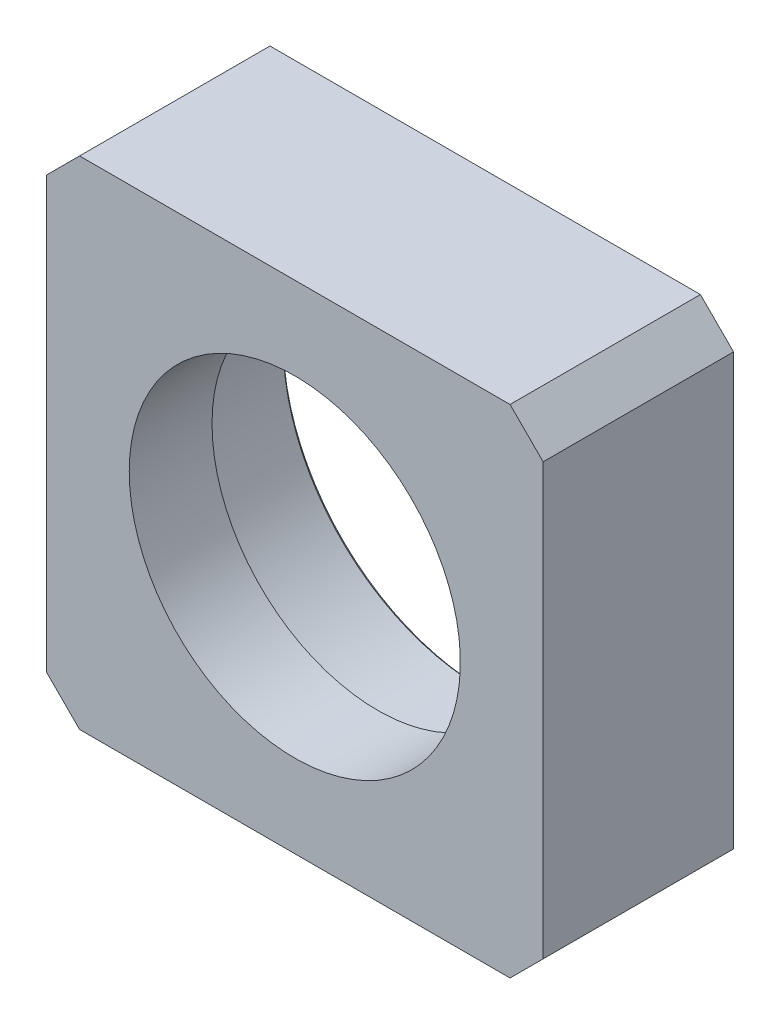
ISO-10303-21;
HEADER;
FILE_DESCRIPTION(('STEP AP214'),'2;1');
FILE_NAME('part.step','',(''),(''),'','','');
FILE_SCHEMA(('AUTOMOTIVE_DESIGN { 1 0 10303 214 1 1 1 1 }'));
ENDSEC;
DATA;
#1=APPLICATION_CONTEXT('core data for automotive mechanical design processes');
#2=APPLICATION_PROTOCOL_DEFINITION('international standard','automotive_design',2000,#1);
#3=PRODUCT_CONTEXT('',#1,'mechanical');
#4=PRODUCT('Part','Part','',(#3));
#5=PRODUCT_RELATED_PRODUCT_CATEGORY('part','',(#4));
#6=PRODUCT_DEFINITION_FORMATION('','',#4);
#7=PRODUCT_DEFINITION_CONTEXT('part definition',#1,'design');
#8=PRODUCT_DEFINITION('design','',#6,#7);
#9=PRODUCT_DEFINITION_SHAPE('','',#8);
#10=(LENGTH_UNIT() NAMED_UNIT(*) SI_UNIT(.MILLI.,.METRE.));
#11=(NAMED_UNIT(*) PLANE_ANGLE_UNIT() SI_UNIT($,.RADIAN.));
#12=(NAMED_UNIT(*) SI_UNIT($,.STERADIAN.) SOLID_ANGLE_UNIT());
#13=UNCERTAINTY_MEASURE_WITH_UNIT(LENGTH_MEASURE(1.E-05),#10,'distance_accuracy_value','');
#14=(GEOMETRIC_REPRESENTATION_CONTEXT(3) GLOBAL_UNCERTAINTY_ASSIGNED_CONTEXT((#13)) GLOBAL_UNIT_ASSIGNED_CONTEXT((#10,
#11,#12)) REPRESENTATION_CONTEXT('',''));
#15=CARTESIAN_POINT('',(0.,0.,0.));
#16=DIRECTION('',(0.,0.,1.));
#17=DIRECTION('',(1.,0.,0.));
#18=AXIS2_PLACEMENT_3D('',#15,#16,#17);
#19=CARTESIAN_POINT('',(-15.,-15.,11.5));
#20=DIRECTION('',(0.,1.,0.));
#21=DIRECTION('',(0.,0.,1.));
#22=AXIS2_PLACEMENT_3D('',#19,#20,#21);
#23=PLANE('',#22);
#24=DIRECTION('',(1.,0.,0.));
#25=VECTOR('',#24,1.);
#26=CARTESIAN_POINT('',(-15.,-15.,11.5));
#27=LINE('',#26,#25);
#28=CARTESIAN_POINT('',(-13.,-15.,11.5));
#29=VERTEX_POINT('',#28);
#30=CARTESIAN_POINT('',(13.,-15.,11.5));
#31=VERTEX_POINT('',#30);
#32=EDGE_CURVE('E121',#29,#31,#27,.T.);
#33=ORIENTED_EDGE('',*,*,#32,.F.);
#34=DIRECTION('',(0.,0.,-1.));
#35=VECTOR('',#34,1.);
#36=CARTESIAN_POINT('',(-13.,-15.,0.));
#37=LINE('',#36,#35);
#38=CARTESIAN_POINT('',(-13.,-15.,0.));
#39=VERTEX_POINT('',#38);
#40=EDGE_CURVE('E106',#29,#39,#37,.T.);
#41=ORIENTED_EDGE('',*,*,#40,.T.);
#42=DIRECTION('',(1.,0.,0.));
#43=VECTOR('',#42,1.);
#44=CARTESIAN_POINT('',(-15.,-15.,0.));
#45=LINE('',#44,#43);
#46=CARTESIAN_POINT('',(13.,-15.,0.));
#47=VERTEX_POINT('',#46);
#48=EDGE_CURVE('E118',#39,#47,#45,.T.);
#49=ORIENTED_EDGE('',*,*,#48,.T.);
#50=DIRECTION('',(0.,0.,1.));
#51=VECTOR('',#50,1.);
#52=CARTESIAN_POINT('',(13.,-15.,11.5));
#53=LINE('',#52,#51);
#54=EDGE_CURVE('E123',#47,#31,#53,.T.);
#55=ORIENTED_EDGE('',*,*,#54,.T.);
#56=EDGE_LOOP('',(#33,#41,#49,#55));
#57=FACE_BOUND('',#56,.T.);
#58=ADVANCED_FACE('F35',(#57),#23,.F.);
#59=CARTESIAN_POINT('',(15.,-15.,11.5));
#60=DIRECTION('',(-1.,0.,0.));
#61=DIRECTION('',(0.,0.,1.));
#62=AXIS2_PLACEMENT_3D('',#59,#60,#61);
#63=PLANE('',#62);
#64=DIRECTION('',(0.,1.,0.));
#65=VECTOR('',#64,1.);
#66=CARTESIAN_POINT('',(15.,-15.,11.5));
#67=LINE('',#66,#65);
#68=CARTESIAN_POINT('',(15.,-13.,11.5));
#69=VERTEX_POINT('',#68);
#70=CARTESIAN_POINT('',(15.,13.,11.5));
#71=VERTEX_POINT('',#70);
#72=EDGE_CURVE('E212',#69,#71,#67,.T.);
#73=ORIENTED_EDGE('',*,*,#72,.F.);
#74=DIRECTION('',(0.,0.,-1.));
#75=VECTOR('',#74,1.);
#76=CARTESIAN_POINT('',(15.,-13.,11.5));
#77=LINE('',#76,#75);
#78=CARTESIAN_POINT('',(15.,-13.,0.));
#79=VERTEX_POINT('',#78);
#80=EDGE_CURVE('E161',#69,#79,#77,.T.);
#81=ORIENTED_EDGE('',*,*,#80,.T.);
#82=DIRECTION('',(0.,1.,0.));
#83=VECTOR('',#82,1.);
#84=CARTESIAN_POINT('',(15.,-15.,0.));
#85=LINE('',#84,#83);
#86=CARTESIAN_POINT('',(15.,13.,0.));
#87=VERTEX_POINT('',#86);
#88=EDGE_CURVE('E127',#79,#87,#85,.T.);
#89=ORIENTED_EDGE('',*,*,#88,.T.);
#90=DIRECTION('',(0.,0.,1.));
#91=VECTOR('',#90,1.);
#92=CARTESIAN_POINT('',(15.,13.,11.5));
#93=LINE('',#92,#91);
#94=EDGE_CURVE('E159',#87,#71,#93,.T.);
#95=ORIENTED_EDGE('',*,*,#94,.T.);
#96=EDGE_LOOP('',(#73,#81,#89,#95));
#97=FACE_BOUND('',#96,.T.);
#98=ADVANCED_FACE('F183',(#97),#63,.F.);
#99=CARTESIAN_POINT('',(-15.,15.,11.5));
#100=DIRECTION('',(0.,1.,0.));
#101=DIRECTION('',(0.,0.,1.));
#102=AXIS2_PLACEMENT_3D('',#99,#100,#101);
#103=PLANE('',#102);
#104=DIRECTION('',(1.,0.,0.));
#105=VECTOR('',#104,1.);
#106=CARTESIAN_POINT('',(-15.,15.,0.));
#107=LINE('',#106,#105);
#108=CARTESIAN_POINT('',(-13.,15.,0.));
#109=VERTEX_POINT('',#108);
#110=CARTESIAN_POINT('',(13.,15.,0.));
#111=VERTEX_POINT('',#110);
#112=EDGE_CURVE('E131',#109,#111,#107,.T.);
#113=ORIENTED_EDGE('',*,*,#112,.F.);
#114=DIRECTION('',(0.,0.,1.));
#115=VECTOR('',#114,1.);
#116=CARTESIAN_POINT('',(-13.,15.,11.5));
#117=LINE('',#116,#115);
#118=CARTESIAN_POINT('',(-13.,15.,11.5));
#119=VERTEX_POINT('',#118);
#120=EDGE_CURVE('E57',#109,#119,#117,.T.);
#121=ORIENTED_EDGE('',*,*,#120,.T.);
#122=DIRECTION('',(1.,0.,0.));
#123=VECTOR('',#122,1.);
#124=CARTESIAN_POINT('',(-15.,15.,11.5));
#125=LINE('',#124,#123);
#126=CARTESIAN_POINT('',(13.,15.,11.5));
#127=VERTEX_POINT('',#126);
#128=EDGE_CURVE('E209',#119,#127,#125,.T.);
#129=ORIENTED_EDGE('',*,*,#128,.T.);
#130=DIRECTION('',(0.,0.,-1.));
#131=VECTOR('',#130,1.);
#132=CARTESIAN_POINT('',(13.,15.,0.));
#133=LINE('',#132,#131);
#134=EDGE_CURVE('E164',#127,#111,#133,.T.);
#135=ORIENTED_EDGE('',*,*,#134,.T.);
#136=EDGE_LOOP('',(#113,#121,#129,#135));
#137=FACE_BOUND('',#136,.T.);
#138=ADVANCED_FACE('F188',(#137),#103,.T.);
#139=CARTESIAN_POINT('',(-15.,-15.,11.5));
#140=DIRECTION('',(-1.,0.,0.));
#141=DIRECTION('',(0.,0.,1.));
#142=AXIS2_PLACEMENT_3D('',#139,#140,#141);
#143=PLANE('',#142);
#144=DIRECTION('',(0.,1.,0.));
#145=VECTOR('',#144,1.);
#146=CARTESIAN_POINT('',(-15.,-15.,0.));
#147=LINE('',#146,#145);
#148=CARTESIAN_POINT('',(-15.,-13.,0.));
#149=VERTEX_POINT('',#148);
#150=CARTESIAN_POINT('',(-15.,13.,0.));
#151=VERTEX_POINT('',#150);
#152=EDGE_CURVE('E142',#149,#151,#147,.T.);
#153=ORIENTED_EDGE('',*,*,#152,.F.);
#154=DIRECTION('',(0.,0.,1.));
#155=VECTOR('',#154,1.);
#156=CARTESIAN_POINT('',(-15.,-13.,11.5));
#157=LINE('',#156,#155);
#158=CARTESIAN_POINT('',(-15.,-13.,11.5));
#159=VERTEX_POINT('',#158);
#160=EDGE_CURVE('E107',#149,#159,#157,.T.);
#161=ORIENTED_EDGE('',*,*,#160,.T.);
#162=DIRECTION('',(0.,1.,0.));
#163=VECTOR('',#162,1.);
#164=CARTESIAN_POINT('',(-15.,-15.,11.5));
#165=LINE('',#164,#163);
#166=CARTESIAN_POINT('',(-15.,13.,11.5));
#167=VERTEX_POINT('',#166);
#168=EDGE_CURVE('E137',#159,#167,#165,.T.);
#169=ORIENTED_EDGE('',*,*,#168,.T.);
#170=DIRECTION('',(0.,0.,-1.));
#171=VECTOR('',#170,1.);
#172=CARTESIAN_POINT('',(-15.,13.,11.5));
#173=LINE('',#172,#171);
#174=EDGE_CURVE('E112',#167,#151,#173,.T.);
#175=ORIENTED_EDGE('',*,*,#174,.T.);
#176=EDGE_LOOP('',(#153,#161,#169,#175));
#177=FACE_BOUND('',#176,.T.);
#178=ADVANCED_FACE('F211',(#177),#143,.T.);
#179=CARTESIAN_POINT('',(0.,0.,11.5));
#180=DIRECTION('',(0.,0.,1.));
#181=DIRECTION('',(1.,0.,0.));
#182=AXIS2_PLACEMENT_3D('',#179,#180,#181);
#183=PLANE('',#182);
#184=CARTESIAN_POINT('',(0.,0.,11.5));
#185=DIRECTION('',(0.,0.,-1.));
#186=DIRECTION('',(-1.,0.,0.));
#187=AXIS2_PLACEMENT_3D('',#184,#185,#186);
#188=CIRCLE('',#187,10.);
#189=CARTESIAN_POINT('',(-10.,0.,11.5));
#190=VERTEX_POINT('',#189);
#191=EDGE_CURVE('E134',#190,#190,#188,.T.);
#192=ORIENTED_EDGE('',*,*,#191,.T.);
#193=EDGE_LOOP('',(#192));
#194=FACE_BOUND('',#193,.T.);
#195=ORIENTED_EDGE('',*,*,#168,.F.);
#196=DIRECTION('',(0.707106781186547,-0.707106781186548,0.));
#197=VECTOR('',#196,1.);
#198=CARTESIAN_POINT('',(-14.,-14.,11.5));
#199=LINE('',#198,#197);
#200=EDGE_CURVE('E157',#159,#29,#199,.T.);
#201=ORIENTED_EDGE('',*,*,#200,.T.);
#202=ORIENTED_EDGE('',*,*,#32,.T.);
#203=DIRECTION('',(-0.707106781186548,-0.707106781186547,0.));
#204=VECTOR('',#203,1.);
#205=CARTESIAN_POINT('',(14.,-14.,11.5));
#206=LINE('',#205,#204);
#207=EDGE_CURVE('E155',#31,#69,#206,.F.);
#208=ORIENTED_EDGE('',*,*,#207,.T.);
#209=ORIENTED_EDGE('',*,*,#72,.T.);
#210=DIRECTION('',(-0.707106781186547,0.707106781186548,0.));
#211=VECTOR('',#210,1.);
#212=CARTESIAN_POINT('',(14.,14.,11.5));
#213=LINE('',#212,#211);
#214=EDGE_CURVE('E50',#71,#127,#213,.T.);
#215=ORIENTED_EDGE('',*,*,#214,.T.);
#216=ORIENTED_EDGE('',*,*,#128,.F.);
#217=DIRECTION('',(0.707106781186548,0.707106781186547,0.));
#218=VECTOR('',#217,1.);
#219=CARTESIAN_POINT('',(-14.,14.,11.5));
#220=LINE('',#219,#218);
#221=EDGE_CURVE('E153',#119,#167,#220,.F.);
#222=ORIENTED_EDGE('',*,*,#221,.T.);
#223=EDGE_LOOP('',(#195,#201,#202,#208,#209,#215,#216,#222));
#224=FACE_BOUND('',#223,.T.);
#225=ADVANCED_FACE('F208',(#194,#224),#183,.T.);
#226=CARTESIAN_POINT('',(0.,0.,0.));
#227=DIRECTION('',(0.,0.,1.));
#228=DIRECTION('',(1.,0.,0.));
#229=AXIS2_PLACEMENT_3D('',#226,#227,#228);
#230=PLANE('',#229);
#231=CARTESIAN_POINT('',(0.,0.,0.));
#232=DIRECTION('',(0.,0.,1.));
#233=DIRECTION('',(1.,0.,0.));
#234=AXIS2_PLACEMENT_3D('',#231,#232,#233);
#235=CIRCLE('',#234,12.2);
#236=CARTESIAN_POINT('',(12.2,0.,0.));
#237=VERTEX_POINT('',#236);
#238=EDGE_CURVE('E11',#237,#237,#235,.T.);
#239=ORIENTED_EDGE('',*,*,#238,.T.);
#240=EDGE_LOOP('',(#239));
#241=FACE_BOUND('',#240,.T.);
#242=ORIENTED_EDGE('',*,*,#48,.F.);
#243=DIRECTION('',(-0.707106781186547,0.707106781186548,0.));
#244=VECTOR('',#243,1.);
#245=CARTESIAN_POINT('',(-13.,-15.,0.));
#246=LINE('',#245,#244);
#247=EDGE_CURVE('E102',#39,#149,#246,.T.);
#248=ORIENTED_EDGE('',*,*,#247,.T.);
#249=ORIENTED_EDGE('',*,*,#152,.T.);
#250=DIRECTION('',(-0.707106781186548,-0.707106781186547,0.));
#251=VECTOR('',#250,1.);
#252=CARTESIAN_POINT('',(-15.,13.,0.));
#253=LINE('',#252,#251);
#254=EDGE_CURVE('E146',#151,#109,#253,.F.);
#255=ORIENTED_EDGE('',*,*,#254,.T.);
#256=ORIENTED_EDGE('',*,*,#112,.T.);
#257=DIRECTION('',(0.707106781186547,-0.707106781186548,0.));
#258=VECTOR('',#257,1.);
#259=CARTESIAN_POINT('',(13.,15.,0.));
#260=LINE('',#259,#258);
#261=EDGE_CURVE('E122',#111,#87,#260,.T.);
#262=ORIENTED_EDGE('',*,*,#261,.T.);
#263=ORIENTED_EDGE('',*,*,#88,.F.);
#264=DIRECTION('',(0.707106781186548,0.707106781186547,0.));
#265=VECTOR('',#264,1.);
#266=CARTESIAN_POINT('',(15.,-13.,0.));
#267=LINE('',#266,#265);
#268=EDGE_CURVE('E113',#79,#47,#267,.F.);
#269=ORIENTED_EDGE('',*,*,#268,.T.);
#270=EDGE_LOOP('',(#242,#248,#249,#255,#256,#262,#263,#269));
#271=FACE_BOUND('',#270,.T.);
#272=ADVANCED_FACE('F125',(#241,#271),#230,.F.);
#273=CARTESIAN_POINT('',(0.,0.,6.5));
#274=DIRECTION('',(0.,0.,-1.));
#275=DIRECTION('',(-1.,0.,0.));
#276=AXIS2_PLACEMENT_3D('',#273,#274,#275);
#277=CYLINDRICAL_SURFACE('',#276,12.);
#278=CARTESIAN_POINT('',(0.,0.,0.200000000000028));
#279=DIRECTION('',(0.,0.,1.));
#280=DIRECTION('',(1.,0.,0.));
#281=AXIS2_PLACEMENT_3D('',#278,#279,#280);
#282=CIRCLE('',#281,12.);
#283=CARTESIAN_POINT('',(12.,0.,0.200000000000028));
#284=VERTEX_POINT('',#283);
#285=EDGE_CURVE('E43',#284,#284,#282,.F.);
#286=ORIENTED_EDGE('',*,*,#285,.T.);
#287=EDGE_LOOP('',(#286));
#288=FACE_BOUND('',#287,.T.);
#289=CARTESIAN_POINT('',(0.,0.,6.5));
#290=DIRECTION('',(0.,0.,-1.));
#291=DIRECTION('',(-1.,0.,0.));
#292=AXIS2_PLACEMENT_3D('',#289,#290,#291);
#293=CIRCLE('',#292,12.);
#294=CARTESIAN_POINT('',(-12.,0.,6.5));
#295=VERTEX_POINT('',#294);
#296=EDGE_CURVE('E128',#295,#295,#293,.T.);
#297=ORIENTED_EDGE('',*,*,#296,.F.);
#298=EDGE_LOOP('',(#297));
#299=FACE_BOUND('',#298,.T.);
#300=ADVANCED_FACE('F170',(#288,#299),#277,.F.);
#301=CARTESIAN_POINT('',(0.,0.,6.5));
#302=DIRECTION('',(0.,0.,-1.));
#303=DIRECTION('',(-1.,0.,0.));
#304=AXIS2_PLACEMENT_3D('',#301,#302,#303);
#305=PLANE('',#304);
#306=CARTESIAN_POINT('',(0.,0.,6.5));
#307=DIRECTION('',(0.,0.,-1.));
#308=DIRECTION('',(-1.,0.,0.));
#309=AXIS2_PLACEMENT_3D('',#306,#307,#308);
#310=CIRCLE('',#309,10.);
#311=CARTESIAN_POINT('',(-10.,0.,6.5));
#312=VERTEX_POINT('',#311);
#313=EDGE_CURVE('E217',#312,#312,#310,.T.);
#314=ORIENTED_EDGE('',*,*,#313,.F.);
#315=EDGE_LOOP('',(#314));
#316=FACE_BOUND('',#315,.T.);
#317=ORIENTED_EDGE('',*,*,#296,.T.);
#318=EDGE_LOOP('',(#317));
#319=FACE_BOUND('',#318,.T.);
#320=ADVANCED_FACE('F226',(#316,#319),#305,.T.);
#321=CARTESIAN_POINT('',(0.,0.,11.5));
#322=DIRECTION('',(0.,0.,-1.));
#323=DIRECTION('',(-1.,0.,0.));
#324=AXIS2_PLACEMENT_3D('',#321,#322,#323);
#325=CYLINDRICAL_SURFACE('',#324,10.);
#326=ORIENTED_EDGE('',*,*,#191,.F.);
#327=EDGE_LOOP('',(#326));
#328=FACE_BOUND('',#327,.T.);
#329=ORIENTED_EDGE('',*,*,#313,.T.);
#330=EDGE_LOOP('',(#329));
#331=FACE_BOUND('',#330,.T.);
#332=ADVANCED_FACE('F196',(#328,#331),#325,.F.);
#333=CARTESIAN_POINT('',(-13.,-15.,11.5));
#334=DIRECTION('',(-0.707106781186548,-0.707106781186547,0.));
#335=DIRECTION('',(0.,0.,1.));
#336=AXIS2_PLACEMENT_3D('',#333,#334,#335);
#337=PLANE('',#336);
#338=ORIENTED_EDGE('',*,*,#200,.F.);
#339=ORIENTED_EDGE('',*,*,#160,.F.);
#340=ORIENTED_EDGE('',*,*,#247,.F.);
#341=ORIENTED_EDGE('',*,*,#40,.F.);
#342=EDGE_LOOP('',(#338,#339,#340,#341));
#343=FACE_BOUND('',#342,.T.);
#344=ADVANCED_FACE('F105',(#343),#337,.T.);
#345=CARTESIAN_POINT('',(15.,-13.,11.5));
#346=DIRECTION('',(-0.707106781186547,0.707106781186548,0.));
#347=DIRECTION('',(0.,0.,-1.));
#348=AXIS2_PLACEMENT_3D('',#345,#346,#347);
#349=PLANE('',#348);
#350=ORIENTED_EDGE('',*,*,#207,.F.);
#351=ORIENTED_EDGE('',*,*,#54,.F.);
#352=ORIENTED_EDGE('',*,*,#268,.F.);
#353=ORIENTED_EDGE('',*,*,#80,.F.);
#354=EDGE_LOOP('',(#350,#351,#352,#353));
#355=FACE_BOUND('',#354,.T.);
#356=ADVANCED_FACE('F195',(#355),#349,.F.);
#357=CARTESIAN_POINT('',(-15.,13.,11.5));
#358=DIRECTION('',(0.707106781186547,-0.707106781186548,0.));
#359=DIRECTION('',(0.,0.,-1.));
#360=AXIS2_PLACEMENT_3D('',#357,#358,#359);
#361=PLANE('',#360);
#362=ORIENTED_EDGE('',*,*,#221,.F.);
#363=ORIENTED_EDGE('',*,*,#120,.F.);
#364=ORIENTED_EDGE('',*,*,#254,.F.);
#365=ORIENTED_EDGE('',*,*,#174,.F.);
#366=EDGE_LOOP('',(#362,#363,#364,#365));
#367=FACE_BOUND('',#366,.T.);
#368=ADVANCED_FACE('F179',(#367),#361,.F.);
#369=CARTESIAN_POINT('',(13.,15.,11.5));
#370=DIRECTION('',(0.707106781186548,0.707106781186547,0.));
#371=DIRECTION('',(0.,0.,1.));
#372=AXIS2_PLACEMENT_3D('',#369,#370,#371);
#373=PLANE('',#372);
#374=ORIENTED_EDGE('',*,*,#214,.F.);
#375=ORIENTED_EDGE('',*,*,#94,.F.);
#376=ORIENTED_EDGE('',*,*,#261,.F.);
#377=ORIENTED_EDGE('',*,*,#134,.F.);
#378=EDGE_LOOP('',(#374,#375,#376,#377));
#379=FACE_BOUND('',#378,.T.);
#380=ADVANCED_FACE('F174',(#379),#373,.T.);
#381=CARTESIAN_POINT('',(0.,0.,0.200000000000028));
#382=DIRECTION('',(0.,0.,-1.));
#383=DIRECTION('',(-1.,0.,0.));
#384=AXIS2_PLACEMENT_3D('',#381,#382,#383);
#385=CONICAL_SURFACE('',#384,12.,0.785398163397444);
#386=ORIENTED_EDGE('',*,*,#238,.F.);
#387=EDGE_LOOP('',(#386));
#388=FACE_BOUND('',#387,.T.);
#389=ORIENTED_EDGE('',*,*,#285,.F.);
#390=EDGE_LOOP('',(#389));
#391=FACE_BOUND('',#390,.T.);
#392=ADVANCED_FACE('F37',(#388,#391),#385,.F.);
#393=CLOSED_SHELL('',(#58,#98,#138,#178,#225,#272,#300,#320,#332,#344,#356,#368,#380,#392));
#394=MANIFOLD_SOLID_BREP('B2',#393);
#395=ADVANCED_BREP_SHAPE_REPRESENTATION('',(#18,#394),#14);
#396=SHAPE_DEFINITION_REPRESENTATION(#9,#395);
ENDSEC;
END-ISO-10303-21;
